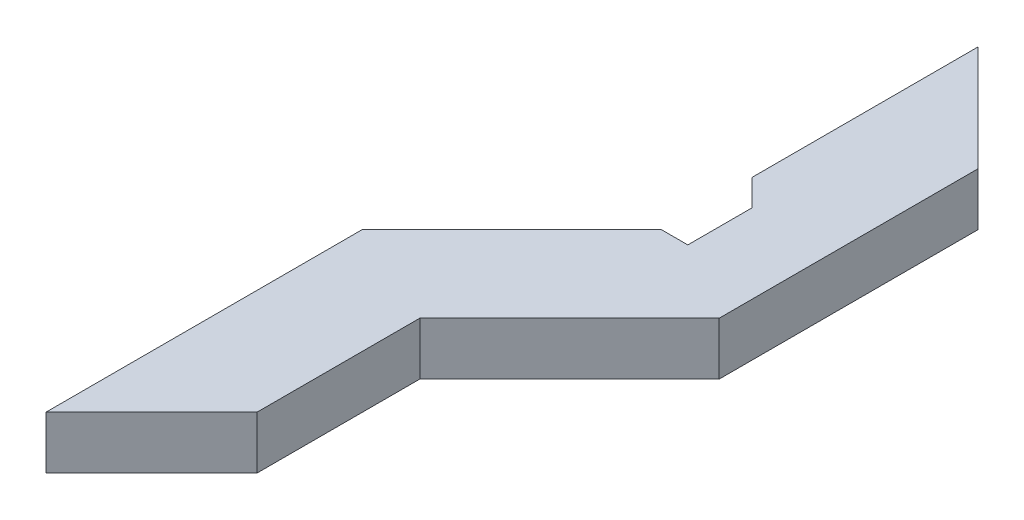
ISO-10303-21;
HEADER;
FILE_DESCRIPTION(('STEP AP214'),'2;1');
FILE_NAME('part.step','',(''),(''),'','','');
FILE_SCHEMA(('AUTOMOTIVE_DESIGN { 1 0 10303 214 1 1 1 1 }'));
ENDSEC;
DATA;
#1=APPLICATION_CONTEXT('core data for automotive mechanical design processes');
#2=APPLICATION_PROTOCOL_DEFINITION('international standard','automotive_design',2000,#1);
#3=PRODUCT_CONTEXT('',#1,'mechanical');
#4=PRODUCT('Part','Part','',(#3));
#5=PRODUCT_RELATED_PRODUCT_CATEGORY('part','',(#4));
#6=PRODUCT_DEFINITION_FORMATION('','',#4);
#7=PRODUCT_DEFINITION_CONTEXT('part definition',#1,'design');
#8=PRODUCT_DEFINITION('design','',#6,#7);
#9=PRODUCT_DEFINITION_SHAPE('','',#8);
#10=(LENGTH_UNIT() NAMED_UNIT(*) SI_UNIT(.MILLI.,.METRE.));
#11=(NAMED_UNIT(*) PLANE_ANGLE_UNIT() SI_UNIT($,.RADIAN.));
#12=(NAMED_UNIT(*) SI_UNIT($,.STERADIAN.) SOLID_ANGLE_UNIT());
#13=UNCERTAINTY_MEASURE_WITH_UNIT(LENGTH_MEASURE(1.E-05),#10,'distance_accuracy_value','');
#14=(GEOMETRIC_REPRESENTATION_CONTEXT(3) GLOBAL_UNCERTAINTY_ASSIGNED_CONTEXT((#13)) GLOBAL_UNIT_ASSIGNED_CONTEXT((#10,
#11,#12)) REPRESENTATION_CONTEXT('',''));
#15=CARTESIAN_POINT('',(0.,0.,0.));
#16=DIRECTION('',(0.,0.,1.));
#17=DIRECTION('',(1.,0.,0.));
#18=AXIS2_PLACEMENT_3D('',#15,#16,#17);
#19=CARTESIAN_POINT('',(3.89708006255632,5.,25.4312418217915));
#20=DIRECTION('',(-0.707106781186549,0.,-0.707106781186546));
#21=DIRECTION('',(-0.707106781186546,0.,0.707106781186549));
#22=AXIS2_PLACEMENT_3D('',#19,#20,#21);
#23=PLANE('',#22);
#24=DIRECTION('',(0.707106781186546,0.,-0.707106781186549));
#25=VECTOR('',#24,1.);
#26=CARTESIAN_POINT('',(3.89708006255632,0.,25.4312418217915));
#27=LINE('',#26,#25);
#28=CARTESIAN_POINT('',(3.89708006255632,0.,25.4312418217915));
#29=VERTEX_POINT('',#28);
#30=CARTESIAN_POINT('',(13.8970800625563,0.,15.4312418217915));
#31=VERTEX_POINT('',#30);
#32=EDGE_CURVE('E147',#29,#31,#27,.T.);
#33=ORIENTED_EDGE('',*,*,#32,.T.);
#34=DIRECTION('',(0.,-1.,0.));
#35=VECTOR('',#34,1.);
#36=CARTESIAN_POINT('',(13.8970800625563,5.,15.4312418217915));
#37=LINE('',#36,#35);
#38=CARTESIAN_POINT('',(13.8970800625563,5.,15.4312418217915));
#39=VERTEX_POINT('',#38);
#40=EDGE_CURVE('E11',#39,#31,#37,.T.);
#41=ORIENTED_EDGE('',*,*,#40,.F.);
#42=DIRECTION('',(0.707106781186546,0.,-0.707106781186549));
#43=VECTOR('',#42,1.);
#44=CARTESIAN_POINT('',(3.89708006255632,5.,25.4312418217915));
#45=LINE('',#44,#43);
#46=CARTESIAN_POINT('',(3.89708006255632,5.,25.4312418217915));
#47=VERTEX_POINT('',#46);
#48=EDGE_CURVE('E167',#47,#39,#45,.T.);
#49=ORIENTED_EDGE('',*,*,#48,.F.);
#50=DIRECTION('',(0.,-1.,0.));
#51=VECTOR('',#50,1.);
#52=CARTESIAN_POINT('',(3.89708006255632,5.,25.4312418217915));
#53=LINE('',#52,#51);
#54=EDGE_CURVE('E143',#47,#29,#53,.T.);
#55=ORIENTED_EDGE('',*,*,#54,.T.);
#56=EDGE_LOOP('',(#33,#41,#49,#55));
#57=FACE_BOUND('',#56,.T.);
#58=ADVANCED_FACE('F33',(#57),#23,.F.);
#59=CARTESIAN_POINT('',(13.8970800625563,5.,15.4312418217915));
#60=DIRECTION('',(-1.,0.,0.));
#61=DIRECTION('',(0.,0.,1.));
#62=AXIS2_PLACEMENT_3D('',#59,#60,#61);
#63=PLANE('',#62);
#64=DIRECTION('',(0.,0.,-1.));
#65=VECTOR('',#64,1.);
#66=CARTESIAN_POINT('',(13.8970800625563,0.,15.4312418217915));
#67=LINE('',#66,#65);
#68=CARTESIAN_POINT('',(13.8970800625563,0.,0.));
#69=VERTEX_POINT('',#68);
#70=EDGE_CURVE('E150',#31,#69,#67,.T.);
#71=ORIENTED_EDGE('',*,*,#70,.T.);
#72=DIRECTION('',(0.,-1.,0.));
#73=VECTOR('',#72,1.);
#74=CARTESIAN_POINT('',(13.8970800625563,5.,0.));
#75=LINE('',#74,#73);
#76=CARTESIAN_POINT('',(13.8970800625563,5.,0.));
#77=VERTEX_POINT('',#76);
#78=EDGE_CURVE('E41',#77,#69,#75,.T.);
#79=ORIENTED_EDGE('',*,*,#78,.F.);
#80=DIRECTION('',(0.,0.,-1.));
#81=VECTOR('',#80,1.);
#82=CARTESIAN_POINT('',(13.8970800625563,5.,15.4312418217915));
#83=LINE('',#82,#81);
#84=EDGE_CURVE('E101',#39,#77,#83,.T.);
#85=ORIENTED_EDGE('',*,*,#84,.F.);
#86=ORIENTED_EDGE('',*,*,#40,.T.);
#87=EDGE_LOOP('',(#71,#79,#85,#86));
#88=FACE_BOUND('',#87,.T.);
#89=ADVANCED_FACE('F239',(#88),#63,.F.);
#90=CARTESIAN_POINT('',(13.8970800625563,5.,0.));
#91=DIRECTION('',(-0.707106781186549,0.,-0.707106781186546));
#92=DIRECTION('',(-0.707106781186546,0.,0.707106781186549));
#93=AXIS2_PLACEMENT_3D('',#90,#91,#92);
#94=PLANE('',#93);
#95=DIRECTION('',(0.707106781186546,0.,-0.707106781186549));
#96=VECTOR('',#95,1.);
#97=CARTESIAN_POINT('',(13.8970800625563,0.,0.));
#98=LINE('',#97,#96);
#99=CARTESIAN_POINT('',(28.0842566166419,0.,-14.1871765540856));
#100=VERTEX_POINT('',#99);
#101=EDGE_CURVE('E152',#69,#100,#98,.T.);
#102=ORIENTED_EDGE('',*,*,#101,.T.);
#103=DIRECTION('',(0.,-1.,0.));
#104=VECTOR('',#103,1.);
#105=CARTESIAN_POINT('',(28.0842566166419,5.,-14.1871765540856));
#106=LINE('',#105,#104);
#107=CARTESIAN_POINT('',(28.0842566166419,5.,-14.1871765540856));
#108=VERTEX_POINT('',#107);
#109=EDGE_CURVE('E183',#108,#100,#106,.T.);
#110=ORIENTED_EDGE('',*,*,#109,.F.);
#111=DIRECTION('',(0.707106781186546,0.,-0.707106781186549));
#112=VECTOR('',#111,1.);
#113=CARTESIAN_POINT('',(13.8970800625563,5.,0.));
#114=LINE('',#113,#112);
#115=EDGE_CURVE('E191',#77,#108,#114,.T.);
#116=ORIENTED_EDGE('',*,*,#115,.F.);
#117=ORIENTED_EDGE('',*,*,#78,.T.);
#118=EDGE_LOOP('',(#102,#110,#116,#117));
#119=FACE_BOUND('',#118,.T.);
#120=ADVANCED_FACE('F189',(#119),#94,.F.);
#121=CARTESIAN_POINT('',(28.0842566166419,5.,-38.7108599904965));
#122=DIRECTION('',(-1.,0.,0.));
#123=DIRECTION('',(0.,0.,1.));
#124=AXIS2_PLACEMENT_3D('',#121,#122,#123);
#125=PLANE('',#124);
#126=DIRECTION('',(0.,0.,-1.));
#127=VECTOR('',#126,1.);
#128=CARTESIAN_POINT('',(28.0842566166419,0.,-38.7108599904965));
#129=LINE('',#128,#127);
#130=CARTESIAN_POINT('',(28.0842566166419,0.,-38.7108599904965));
#131=VERTEX_POINT('',#130);
#132=EDGE_CURVE('E154',#100,#131,#129,.T.);
#133=ORIENTED_EDGE('',*,*,#132,.T.);
#134=DIRECTION('',(0.,-1.,0.));
#135=VECTOR('',#134,1.);
#136=CARTESIAN_POINT('',(28.0842566166419,5.,-38.7108599904965));
#137=LINE('',#136,#135);
#138=CARTESIAN_POINT('',(28.0842566166419,5.,-38.7108599904965));
#139=VERTEX_POINT('',#138);
#140=EDGE_CURVE('E180',#139,#131,#137,.T.);
#141=ORIENTED_EDGE('',*,*,#140,.F.);
#142=DIRECTION('',(0.,0.,-1.));
#143=VECTOR('',#142,1.);
#144=CARTESIAN_POINT('',(28.0842566166419,5.,-38.7108599904965));
#145=LINE('',#144,#143);
#146=EDGE_CURVE('E209',#108,#139,#145,.T.);
#147=ORIENTED_EDGE('',*,*,#146,.F.);
#148=ORIENTED_EDGE('',*,*,#109,.T.);
#149=EDGE_LOOP('',(#133,#141,#147,#148));
#150=FACE_BOUND('',#149,.T.);
#151=ADVANCED_FACE('F200',(#150),#125,.F.);
#152=CARTESIAN_POINT('',(18.0842566166409,5.,-48.7108599904971));
#153=DIRECTION('',(-0.707106781186536,0.,0.707106781186559));
#154=DIRECTION('',(0.707106781186559,0.,0.707106781186536));
#155=AXIS2_PLACEMENT_3D('',#152,#153,#154);
#156=PLANE('',#155);
#157=DIRECTION('',(-0.707106781186559,0.,-0.707106781186536));
#158=VECTOR('',#157,1.);
#159=CARTESIAN_POINT('',(18.0842566166409,0.,-48.7108599904971));
#160=LINE('',#159,#158);
#161=CARTESIAN_POINT('',(18.0842566166409,0.,-48.7108599904971));
#162=VERTEX_POINT('',#161);
#163=EDGE_CURVE('E156',#131,#162,#160,.T.);
#164=ORIENTED_EDGE('',*,*,#163,.T.);
#165=DIRECTION('',(0.,-1.,0.));
#166=VECTOR('',#165,1.);
#167=CARTESIAN_POINT('',(18.0842566166409,5.,-48.7108599904971));
#168=LINE('',#167,#166);
#169=CARTESIAN_POINT('',(18.0842566166409,5.,-48.7108599904971));
#170=VERTEX_POINT('',#169);
#171=EDGE_CURVE('E177',#170,#162,#168,.T.);
#172=ORIENTED_EDGE('',*,*,#171,.F.);
#173=DIRECTION('',(-0.707106781186559,0.,-0.707106781186536));
#174=VECTOR('',#173,1.);
#175=CARTESIAN_POINT('',(18.0842566166409,5.,-48.7108599904971));
#176=LINE('',#175,#174);
#177=EDGE_CURVE('E206',#139,#170,#176,.T.);
#178=ORIENTED_EDGE('',*,*,#177,.F.);
#179=ORIENTED_EDGE('',*,*,#140,.T.);
#180=EDGE_LOOP('',(#164,#172,#178,#179));
#181=FACE_BOUND('',#180,.T.);
#182=ADVANCED_FACE('F204',(#181),#156,.F.);
#183=CARTESIAN_POINT('',(18.0842566166409,5.,-27.316281172271));
#184=DIRECTION('',(1.,0.,0.));
#185=DIRECTION('',(0.,0.,-1.));
#186=AXIS2_PLACEMENT_3D('',#183,#184,#185);
#187=PLANE('',#186);
#188=DIRECTION('',(0.,0.,1.));
#189=VECTOR('',#188,1.);
#190=CARTESIAN_POINT('',(18.0842566166409,0.,-27.316281172271));
#191=LINE('',#190,#189);
#192=CARTESIAN_POINT('',(18.0842566166409,0.,-27.316281172271));
#193=VERTEX_POINT('',#192);
#194=EDGE_CURVE('E158',#162,#193,#191,.T.);
#195=ORIENTED_EDGE('',*,*,#194,.T.);
#196=DIRECTION('',(0.,-1.,0.));
#197=VECTOR('',#196,1.);
#198=CARTESIAN_POINT('',(18.0842566166409,5.,-27.316281172271));
#199=LINE('',#198,#197);
#200=CARTESIAN_POINT('',(18.0842566166409,5.,-27.316281172271));
#201=VERTEX_POINT('',#200);
#202=EDGE_CURVE('E174',#201,#193,#199,.T.);
#203=ORIENTED_EDGE('',*,*,#202,.F.);
#204=DIRECTION('',(0.,0.,1.));
#205=VECTOR('',#204,1.);
#206=CARTESIAN_POINT('',(18.0842566166409,5.,-27.316281172271));
#207=LINE('',#206,#205);
#208=EDGE_CURVE('E208',#170,#201,#207,.T.);
#209=ORIENTED_EDGE('',*,*,#208,.F.);
#210=ORIENTED_EDGE('',*,*,#171,.T.);
#211=EDGE_LOOP('',(#195,#203,#209,#210));
#212=FACE_BOUND('',#211,.T.);
#213=ADVANCED_FACE('F252',(#212),#187,.F.);
#214=CARTESIAN_POINT('',(18.0842566166409,5.,-27.316281172271));
#215=DIRECTION('',(0.713394599518065,0.,-0.700762545644714));
#216=DIRECTION('',(-0.700762545644714,0.,-0.713394599518065));
#217=AXIS2_PLACEMENT_3D('',#214,#215,#216);
#218=PLANE('',#217);
#219=DIRECTION('',(0.700762545644714,0.,0.713394599518065));
#220=VECTOR('',#219,1.);
#221=CARTESIAN_POINT('',(18.0842566166409,0.,-27.316281172271));
#222=LINE('',#221,#220);
#223=CARTESIAN_POINT('',(20.5828999365348,0.,-24.7725969220029));
#224=VERTEX_POINT('',#223);
#225=EDGE_CURVE('E160',#193,#224,#222,.T.);
#226=ORIENTED_EDGE('',*,*,#225,.T.);
#227=DIRECTION('',(0.,-1.,0.));
#228=VECTOR('',#227,1.);
#229=CARTESIAN_POINT('',(20.5828999365348,5.,-24.7725969220029));
#230=LINE('',#229,#228);
#231=CARTESIAN_POINT('',(20.5828999365348,5.,-24.7725969220029));
#232=VERTEX_POINT('',#231);
#233=EDGE_CURVE('E171',#232,#224,#230,.T.);
#234=ORIENTED_EDGE('',*,*,#233,.F.);
#235=DIRECTION('',(0.700762545644714,0.,0.713394599518065));
#236=VECTOR('',#235,1.);
#237=CARTESIAN_POINT('',(18.0842566166409,5.,-27.316281172271));
#238=LINE('',#237,#236);
#239=EDGE_CURVE('E211',#201,#232,#238,.T.);
#240=ORIENTED_EDGE('',*,*,#239,.F.);
#241=ORIENTED_EDGE('',*,*,#202,.T.);
#242=EDGE_LOOP('',(#226,#234,#240,#241));
#243=FACE_BOUND('',#242,.T.);
#244=ADVANCED_FACE('F220',(#243),#218,.F.);
#245=CARTESIAN_POINT('',(20.5828999365348,5.,-24.7725969220029));
#246=DIRECTION('',(1.,0.,0.));
#247=DIRECTION('',(0.,0.,-1.));
#248=AXIS2_PLACEMENT_3D('',#245,#246,#247);
#249=PLANE('',#248);
#250=DIRECTION('',(0.,0.,1.));
#251=VECTOR('',#250,1.);
#252=CARTESIAN_POINT('',(20.5828999365348,0.,-24.7725969220029));
#253=LINE('',#252,#251);
#254=CARTESIAN_POINT('',(20.5828999365348,0.,-18.7108938019394));
#255=VERTEX_POINT('',#254);
#256=EDGE_CURVE('E162',#224,#255,#253,.T.);
#257=ORIENTED_EDGE('',*,*,#256,.T.);
#258=DIRECTION('',(0.,-1.,0.));
#259=VECTOR('',#258,1.);
#260=CARTESIAN_POINT('',(20.5828999365348,5.,-18.7108938019394));
#261=LINE('',#260,#259);
#262=CARTESIAN_POINT('',(20.5828999365348,5.,-18.7108938019394));
#263=VERTEX_POINT('',#262);
#264=EDGE_CURVE('E138',#263,#255,#261,.T.);
#265=ORIENTED_EDGE('',*,*,#264,.F.);
#266=DIRECTION('',(0.,0.,1.));
#267=VECTOR('',#266,1.);
#268=CARTESIAN_POINT('',(20.5828999365348,5.,-24.7725969220029));
#269=LINE('',#268,#267);
#270=EDGE_CURVE('E129',#232,#263,#269,.T.);
#271=ORIENTED_EDGE('',*,*,#270,.F.);
#272=ORIENTED_EDGE('',*,*,#233,.T.);
#273=EDGE_LOOP('',(#257,#265,#271,#272));
#274=FACE_BOUND('',#273,.T.);
#275=ADVANCED_FACE('F224',(#274),#249,.F.);
#276=CARTESIAN_POINT('',(18.039215686287,5.,-18.7108938019397));
#277=DIRECTION('',(0.,0.,1.));
#278=DIRECTION('',(1.,0.,0.));
#279=AXIS2_PLACEMENT_3D('',#276,#277,#278);
#280=PLANE('',#279);
#281=DIRECTION('',(-1.,0.,0.));
#282=VECTOR('',#281,1.);
#283=CARTESIAN_POINT('',(18.039215686287,0.,-18.7108938019397));
#284=LINE('',#283,#282);
#285=CARTESIAN_POINT('',(18.039215686287,0.,-18.7108938019397));
#286=VERTEX_POINT('',#285);
#287=EDGE_CURVE('E137',#255,#286,#284,.T.);
#288=ORIENTED_EDGE('',*,*,#287,.T.);
#289=DIRECTION('',(0.,-1.,0.));
#290=VECTOR('',#289,1.);
#291=CARTESIAN_POINT('',(18.039215686287,5.,-18.7108938019397));
#292=LINE('',#291,#290);
#293=CARTESIAN_POINT('',(18.039215686287,5.,-18.7108938019397));
#294=VERTEX_POINT('',#293);
#295=EDGE_CURVE('E134',#294,#286,#292,.T.);
#296=ORIENTED_EDGE('',*,*,#295,.F.);
#297=DIRECTION('',(-1.,0.,0.));
#298=VECTOR('',#297,1.);
#299=CARTESIAN_POINT('',(18.039215686287,5.,-18.7108938019397));
#300=LINE('',#299,#298);
#301=EDGE_CURVE('E123',#263,#294,#300,.T.);
#302=ORIENTED_EDGE('',*,*,#301,.F.);
#303=ORIENTED_EDGE('',*,*,#264,.T.);
#304=EDGE_LOOP('',(#288,#296,#302,#303));
#305=FACE_BOUND('',#304,.T.);
#306=ADVANCED_FACE('F135',(#305),#280,.F.);
#307=CARTESIAN_POINT('',(3.89708006255632,5.,-4.56875817820846));
#308=DIRECTION('',(0.70710678118656,0.,0.707106781186535));
#309=DIRECTION('',(0.707106781186535,0.,-0.70710678118656));
#310=AXIS2_PLACEMENT_3D('',#307,#308,#309);
#311=PLANE('',#310);
#312=DIRECTION('',(-0.707106781186535,0.,0.70710678118656));
#313=VECTOR('',#312,1.);
#314=CARTESIAN_POINT('',(3.89708006255632,0.,-4.56875817820846));
#315=LINE('',#314,#313);
#316=CARTESIAN_POINT('',(3.89708006255632,0.,-4.56875817820846));
#317=VERTEX_POINT('',#316);
#318=EDGE_CURVE('E87',#286,#317,#315,.T.);
#319=ORIENTED_EDGE('',*,*,#318,.T.);
#320=DIRECTION('',(0.,-1.,0.));
#321=VECTOR('',#320,1.);
#322=CARTESIAN_POINT('',(3.89708006255632,5.,-4.56875817820846));
#323=LINE('',#322,#321);
#324=CARTESIAN_POINT('',(3.89708006255632,5.,-4.56875817820846));
#325=VERTEX_POINT('',#324);
#326=EDGE_CURVE('E139',#325,#317,#323,.T.);
#327=ORIENTED_EDGE('',*,*,#326,.F.);
#328=DIRECTION('',(-0.707106781186535,0.,0.70710678118656));
#329=VECTOR('',#328,1.);
#330=CARTESIAN_POINT('',(3.89708006255632,5.,-4.56875817820846));
#331=LINE('',#330,#329);
#332=EDGE_CURVE('E127',#294,#325,#331,.T.);
#333=ORIENTED_EDGE('',*,*,#332,.F.);
#334=ORIENTED_EDGE('',*,*,#295,.T.);
#335=EDGE_LOOP('',(#319,#327,#333,#334));
#336=FACE_BOUND('',#335,.T.);
#337=ADVANCED_FACE('F141',(#336),#311,.F.);
#338=CARTESIAN_POINT('',(3.89708006255632,5.,25.4312418217915));
#339=DIRECTION('',(1.,0.,0.));
#340=DIRECTION('',(0.,0.,-1.));
#341=AXIS2_PLACEMENT_3D('',#338,#339,#340);
#342=PLANE('',#341);
#343=DIRECTION('',(0.,0.,1.));
#344=VECTOR('',#343,1.);
#345=CARTESIAN_POINT('',(3.89708006255632,0.,25.4312418217915));
#346=LINE('',#345,#344);
#347=EDGE_CURVE('E93',#317,#29,#346,.T.);
#348=ORIENTED_EDGE('',*,*,#347,.T.);
#349=ORIENTED_EDGE('',*,*,#54,.F.);
#350=DIRECTION('',(0.,0.,1.));
#351=VECTOR('',#350,1.);
#352=CARTESIAN_POINT('',(3.89708006255632,5.,25.4312418217915));
#353=LINE('',#352,#351);
#354=EDGE_CURVE('E49',#325,#47,#353,.T.);
#355=ORIENTED_EDGE('',*,*,#354,.F.);
#356=ORIENTED_EDGE('',*,*,#326,.T.);
#357=EDGE_LOOP('',(#348,#349,#355,#356));
#358=FACE_BOUND('',#357,.T.);
#359=ADVANCED_FACE('F228',(#358),#342,.F.);
#360=CARTESIAN_POINT('',(0.,5.,0.));
#361=DIRECTION('',(0.,-1.,0.));
#362=DIRECTION('',(0.,0.,-1.));
#363=AXIS2_PLACEMENT_3D('',#360,#361,#362);
#364=PLANE('',#363);
#365=ORIENTED_EDGE('',*,*,#48,.T.);
#366=ORIENTED_EDGE('',*,*,#84,.T.);
#367=ORIENTED_EDGE('',*,*,#115,.T.);
#368=ORIENTED_EDGE('',*,*,#146,.T.);
#369=ORIENTED_EDGE('',*,*,#177,.T.);
#370=ORIENTED_EDGE('',*,*,#208,.T.);
#371=ORIENTED_EDGE('',*,*,#239,.T.);
#372=ORIENTED_EDGE('',*,*,#270,.T.);
#373=ORIENTED_EDGE('',*,*,#301,.T.);
#374=ORIENTED_EDGE('',*,*,#332,.T.);
#375=ORIENTED_EDGE('',*,*,#354,.T.);
#376=EDGE_LOOP('',(#365,#366,#367,#368,#369,#370,#371,#372,#373,#374,#375));
#377=FACE_BOUND('',#376,.T.);
#378=ADVANCED_FACE('F125',(#377),#364,.F.);
#379=CARTESIAN_POINT('',(0.,0.,0.));
#380=DIRECTION('',(0.,-1.,0.));
#381=DIRECTION('',(0.,0.,-1.));
#382=AXIS2_PLACEMENT_3D('',#379,#380,#381);
#383=PLANE('',#382);
#384=ORIENTED_EDGE('',*,*,#32,.F.);
#385=ORIENTED_EDGE('',*,*,#347,.F.);
#386=ORIENTED_EDGE('',*,*,#318,.F.);
#387=ORIENTED_EDGE('',*,*,#287,.F.);
#388=ORIENTED_EDGE('',*,*,#256,.F.);
#389=ORIENTED_EDGE('',*,*,#225,.F.);
#390=ORIENTED_EDGE('',*,*,#194,.F.);
#391=ORIENTED_EDGE('',*,*,#163,.F.);
#392=ORIENTED_EDGE('',*,*,#132,.F.);
#393=ORIENTED_EDGE('',*,*,#101,.F.);
#394=ORIENTED_EDGE('',*,*,#70,.F.);
#395=EDGE_LOOP('',(#384,#385,#386,#387,#388,#389,#390,#391,#392,#393,#394));
#396=FACE_BOUND('',#395,.T.);
#397=ADVANCED_FACE('F195',(#396),#383,.T.);
#398=CLOSED_SHELL('',(#58,#89,#120,#151,#182,#213,#244,#275,#306,#337,#359,#378,#397));
#399=MANIFOLD_SOLID_BREP('B2',#398);
#400=ADVANCED_BREP_SHAPE_REPRESENTATION('',(#18,#399),#14);
#401=SHAPE_DEFINITION_REPRESENTATION(#9,#400);
ENDSEC;
END-ISO-10303-21;
